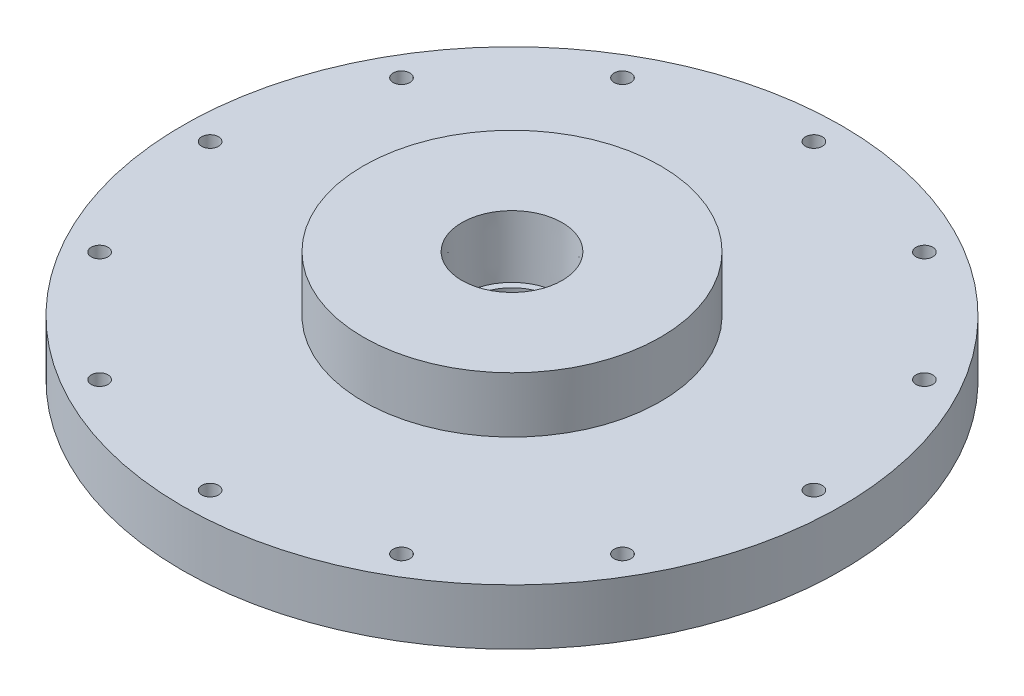
ISO-10303-21;
HEADER;
FILE_DESCRIPTION(('STEP AP214'),'2;1');
FILE_NAME('part.step','',(''),(''),'','','');
FILE_SCHEMA(('AUTOMOTIVE_DESIGN { 1 0 10303 214 1 1 1 1 }'));
ENDSEC;
DATA;
#1=APPLICATION_CONTEXT('core data for automotive mechanical design processes');
#2=APPLICATION_PROTOCOL_DEFINITION('international standard','automotive_design',2000,#1);
#3=PRODUCT_CONTEXT('',#1,'mechanical');
#4=PRODUCT('Part','Part','',(#3));
#5=PRODUCT_RELATED_PRODUCT_CATEGORY('part','',(#4));
#6=PRODUCT_DEFINITION_FORMATION('','',#4);
#7=PRODUCT_DEFINITION_CONTEXT('part definition',#1,'design');
#8=PRODUCT_DEFINITION('design','',#6,#7);
#9=PRODUCT_DEFINITION_SHAPE('','',#8);
#10=(LENGTH_UNIT() NAMED_UNIT(*) SI_UNIT(.MILLI.,.METRE.));
#11=(NAMED_UNIT(*) PLANE_ANGLE_UNIT() SI_UNIT($,.RADIAN.));
#12=(NAMED_UNIT(*) SI_UNIT($,.STERADIAN.) SOLID_ANGLE_UNIT());
#13=UNCERTAINTY_MEASURE_WITH_UNIT(LENGTH_MEASURE(1.E-05),#10,'distance_accuracy_value','');
#14=(GEOMETRIC_REPRESENTATION_CONTEXT(3) GLOBAL_UNCERTAINTY_ASSIGNED_CONTEXT((#13)) GLOBAL_UNIT_ASSIGNED_CONTEXT((#10,
#11,#12)) REPRESENTATION_CONTEXT('',''));
#15=CARTESIAN_POINT('',(0.,0.,0.));
#16=DIRECTION('',(0.,0.,1.));
#17=DIRECTION('',(1.,0.,0.));
#18=AXIS2_PLACEMENT_3D('',#15,#16,#17);
#19=CARTESIAN_POINT('',(0.,19.05,0.));
#20=DIRECTION('',(0.,-1.,0.));
#21=DIRECTION('',(0.,0.,-1.));
#22=AXIS2_PLACEMENT_3D('',#19,#20,#21);
#23=CYLINDRICAL_SURFACE('',#22,25.4);
#24=CARTESIAN_POINT('',(0.,19.05,0.));
#25=DIRECTION('',(0.,1.,0.));
#26=DIRECTION('',(0.,0.,1.));
#27=AXIS2_PLACEMENT_3D('',#24,#25,#26);
#28=CIRCLE('',#27,25.4);
#29=CARTESIAN_POINT('',(0.,19.05,25.4));
#30=VERTEX_POINT('',#29);
#31=EDGE_CURVE('E44',#30,#30,#28,.T.);
#32=ORIENTED_EDGE('',*,*,#31,.F.);
#33=EDGE_LOOP('',(#32));
#34=FACE_BOUND('',#33,.T.);
#35=CARTESIAN_POINT('',(0.,9.525,0.));
#36=DIRECTION('',(0.,-1.,0.));
#37=DIRECTION('',(0.,0.,-1.));
#38=AXIS2_PLACEMENT_3D('',#35,#36,#37);
#39=CIRCLE('',#38,25.4);
#40=CARTESIAN_POINT('',(0.,9.525,-25.4));
#41=VERTEX_POINT('',#40);
#42=EDGE_CURVE('E10',#41,#41,#39,.T.);
#43=ORIENTED_EDGE('',*,*,#42,.F.);
#44=EDGE_LOOP('',(#43));
#45=FACE_BOUND('',#44,.T.);
#46=ADVANCED_FACE('F37',(#34,#45),#23,.T.);
#47=CARTESIAN_POINT('',(0.,19.05,0.));
#48=DIRECTION('',(0.,1.,0.));
#49=DIRECTION('',(0.,0.,1.));
#50=AXIS2_PLACEMENT_3D('',#47,#48,#49);
#51=PLANE('',#50);
#52=CARTESIAN_POINT('',(0.,19.05,0.));
#53=DIRECTION('',(0.,1.,0.));
#54=DIRECTION('',(0.,0.,1.));
#55=AXIS2_PLACEMENT_3D('',#52,#53,#54);
#56=CIRCLE('',#55,8.5750146);
#57=CARTESIAN_POINT('',(0.,19.05,8.5750146));
#58=VERTEX_POINT('',#57);
#59=EDGE_CURVE('E137',#58,#58,#56,.T.);
#60=ORIENTED_EDGE('',*,*,#59,.F.);
#61=EDGE_LOOP('',(#60));
#62=FACE_BOUND('',#61,.T.);
#63=ORIENTED_EDGE('',*,*,#31,.T.);
#64=EDGE_LOOP('',(#63));
#65=FACE_BOUND('',#64,.T.);
#66=ADVANCED_FACE('F143',(#62,#65),#51,.T.);
#67=CARTESIAN_POINT('',(0.,9.525,0.));
#68=DIRECTION('',(0.,-1.,0.));
#69=DIRECTION('',(0.,0.,-1.));
#70=AXIS2_PLACEMENT_3D('',#67,#68,#69);
#71=CYLINDRICAL_SURFACE('',#70,56.35625);
#72=CARTESIAN_POINT('',(0.,9.525,0.));
#73=DIRECTION('',(0.,-1.,0.));
#74=DIRECTION('',(0.,0.,-1.));
#75=AXIS2_PLACEMENT_3D('',#72,#73,#74);
#76=CIRCLE('',#75,56.35625);
#77=CARTESIAN_POINT('',(0.,9.525,-56.35625));
#78=VERTEX_POINT('',#77);
#79=EDGE_CURVE('E48',#78,#78,#76,.T.);
#80=ORIENTED_EDGE('',*,*,#79,.T.);
#81=EDGE_LOOP('',(#80));
#82=FACE_BOUND('',#81,.T.);
#83=CARTESIAN_POINT('',(0.,0.,0.));
#84=DIRECTION('',(0.,-1.,0.));
#85=DIRECTION('',(0.,0.,-1.));
#86=AXIS2_PLACEMENT_3D('',#83,#84,#85);
#87=CIRCLE('',#86,56.35625);
#88=CARTESIAN_POINT('',(0.,0.,-56.35625));
#89=VERTEX_POINT('',#88);
#90=EDGE_CURVE('E51',#89,#89,#87,.T.);
#91=ORIENTED_EDGE('',*,*,#90,.F.);
#92=EDGE_LOOP('',(#91));
#93=FACE_BOUND('',#92,.T.);
#94=ADVANCED_FACE('F146',(#82,#93),#71,.T.);
#95=CARTESIAN_POINT('',(0.,9.525,0.));
#96=DIRECTION('',(0.,-1.,0.));
#97=DIRECTION('',(0.,0.,-1.));
#98=AXIS2_PLACEMENT_3D('',#95,#96,#97);
#99=PLANE('',#98);
#100=CARTESIAN_POINT('',(44.7089944830735,9.525,-25.81275));
#101=DIRECTION('',(0.,-1.,0.));
#102=DIRECTION('',(0.,0.,-1.));
#103=AXIS2_PLACEMENT_3D('',#100,#101,#102);
#104=CIRCLE('',#103,1.4351);
#105=CARTESIAN_POINT('',(44.7089944830735,9.525,-27.24785));
#106=VERTEX_POINT('',#105);
#107=EDGE_CURVE('E122',#106,#106,#104,.T.);
#108=ORIENTED_EDGE('',*,*,#107,.T.);
#109=EDGE_LOOP('',(#108));
#110=FACE_BOUND('',#109,.T.);
#111=CARTESIAN_POINT('',(25.81275,9.525,-44.7089944830735));
#112=DIRECTION('',(0.,-1.,0.));
#113=DIRECTION('',(0.,0.,-1.));
#114=AXIS2_PLACEMENT_3D('',#111,#112,#113);
#115=CIRCLE('',#114,1.4351);
#116=CARTESIAN_POINT('',(25.81275,9.525,-46.1440944830735));
#117=VERTEX_POINT('',#116);
#118=EDGE_CURVE('E116',#117,#117,#115,.T.);
#119=ORIENTED_EDGE('',*,*,#118,.T.);
#120=EDGE_LOOP('',(#119));
#121=FACE_BOUND('',#120,.T.);
#122=CARTESIAN_POINT('',(0.,9.525,-51.6255));
#123=DIRECTION('',(0.,-1.,0.));
#124=DIRECTION('',(0.,0.,-1.));
#125=AXIS2_PLACEMENT_3D('',#122,#123,#124);
#126=CIRCLE('',#125,1.4351);
#127=CARTESIAN_POINT('',(0.,9.525,-53.0606));
#128=VERTEX_POINT('',#127);
#129=EDGE_CURVE('E110',#128,#128,#126,.T.);
#130=ORIENTED_EDGE('',*,*,#129,.T.);
#131=EDGE_LOOP('',(#130));
#132=FACE_BOUND('',#131,.T.);
#133=CARTESIAN_POINT('',(-25.81275,9.525,-44.7089944830735));
#134=DIRECTION('',(0.,-1.,0.));
#135=DIRECTION('',(0.,0.,-1.));
#136=AXIS2_PLACEMENT_3D('',#133,#134,#135);
#137=CIRCLE('',#136,1.4351);
#138=CARTESIAN_POINT('',(-25.81275,9.525,-46.1440944830736));
#139=VERTEX_POINT('',#138);
#140=EDGE_CURVE('E104',#139,#139,#137,.T.);
#141=ORIENTED_EDGE('',*,*,#140,.T.);
#142=EDGE_LOOP('',(#141));
#143=FACE_BOUND('',#142,.T.);
#144=CARTESIAN_POINT('',(-44.7089944830735,9.525,-25.81275));
#145=DIRECTION('',(0.,-1.,0.));
#146=DIRECTION('',(0.,0.,-1.));
#147=AXIS2_PLACEMENT_3D('',#144,#145,#146);
#148=CIRCLE('',#147,1.43509999999999);
#149=CARTESIAN_POINT('',(-44.7089944830735,9.525,-27.24785));
#150=VERTEX_POINT('',#149);
#151=EDGE_CURVE('E98',#150,#150,#148,.T.);
#152=ORIENTED_EDGE('',*,*,#151,.T.);
#153=EDGE_LOOP('',(#152));
#154=FACE_BOUND('',#153,.T.);
#155=CARTESIAN_POINT('',(-51.6255,9.525,0.));
#156=DIRECTION('',(0.,-1.,0.));
#157=DIRECTION('',(0.,0.,-1.));
#158=AXIS2_PLACEMENT_3D('',#155,#156,#157);
#159=CIRCLE('',#158,1.43509999999999);
#160=CARTESIAN_POINT('',(-51.6255,9.525,-1.43509999999999));
#161=VERTEX_POINT('',#160);
#162=EDGE_CURVE('E92',#161,#161,#159,.T.);
#163=ORIENTED_EDGE('',*,*,#162,.T.);
#164=EDGE_LOOP('',(#163));
#165=FACE_BOUND('',#164,.T.);
#166=CARTESIAN_POINT('',(-44.7089944830735,9.525,25.81275));
#167=DIRECTION('',(0.,-1.,0.));
#168=DIRECTION('',(0.,0.,-1.));
#169=AXIS2_PLACEMENT_3D('',#166,#167,#168);
#170=CIRCLE('',#169,1.4351);
#171=CARTESIAN_POINT('',(-44.7089944830735,9.525,24.37765));
#172=VERTEX_POINT('',#171);
#173=EDGE_CURVE('E86',#172,#172,#170,.T.);
#174=ORIENTED_EDGE('',*,*,#173,.T.);
#175=EDGE_LOOP('',(#174));
#176=FACE_BOUND('',#175,.T.);
#177=CARTESIAN_POINT('',(-25.81275,9.525,44.7089944830735));
#178=DIRECTION('',(0.,-1.,0.));
#179=DIRECTION('',(0.,0.,-1.));
#180=AXIS2_PLACEMENT_3D('',#177,#178,#179);
#181=CIRCLE('',#180,1.4351);
#182=CARTESIAN_POINT('',(-25.81275,9.525,43.2738944830735));
#183=VERTEX_POINT('',#182);
#184=EDGE_CURVE('E80',#183,#183,#181,.T.);
#185=ORIENTED_EDGE('',*,*,#184,.T.);
#186=EDGE_LOOP('',(#185));
#187=FACE_BOUND('',#186,.T.);
#188=CARTESIAN_POINT('',(0.,9.525,51.6255));
#189=DIRECTION('',(0.,-1.,0.));
#190=DIRECTION('',(0.,0.,-1.));
#191=AXIS2_PLACEMENT_3D('',#188,#189,#190);
#192=CIRCLE('',#191,1.4351);
#193=CARTESIAN_POINT('',(0.,9.525,50.1904));
#194=VERTEX_POINT('',#193);
#195=EDGE_CURVE('E74',#194,#194,#192,.T.);
#196=ORIENTED_EDGE('',*,*,#195,.T.);
#197=EDGE_LOOP('',(#196));
#198=FACE_BOUND('',#197,.T.);
#199=CARTESIAN_POINT('',(25.81275,9.525,44.7089944830735));
#200=DIRECTION('',(0.,-1.,0.));
#201=DIRECTION('',(0.,0.,-1.));
#202=AXIS2_PLACEMENT_3D('',#199,#200,#201);
#203=CIRCLE('',#202,1.4351);
#204=CARTESIAN_POINT('',(25.81275,9.525,43.2738944830735));
#205=VERTEX_POINT('',#204);
#206=EDGE_CURVE('E68',#205,#205,#203,.T.);
#207=ORIENTED_EDGE('',*,*,#206,.T.);
#208=EDGE_LOOP('',(#207));
#209=FACE_BOUND('',#208,.T.);
#210=CARTESIAN_POINT('',(44.7089944830735,9.525,25.81275));
#211=DIRECTION('',(0.,-1.,0.));
#212=DIRECTION('',(0.,0.,-1.));
#213=AXIS2_PLACEMENT_3D('',#210,#211,#212);
#214=CIRCLE('',#213,1.4351);
#215=CARTESIAN_POINT('',(44.7089944830735,9.525,24.37765));
#216=VERTEX_POINT('',#215);
#217=EDGE_CURVE('E62',#216,#216,#214,.T.);
#218=ORIENTED_EDGE('',*,*,#217,.T.);
#219=EDGE_LOOP('',(#218));
#220=FACE_BOUND('',#219,.T.);
#221=CARTESIAN_POINT('',(51.6255,9.525,0.));
#222=DIRECTION('',(0.,-1.,0.));
#223=DIRECTION('',(0.,0.,-1.));
#224=AXIS2_PLACEMENT_3D('',#221,#222,#223);
#225=CIRCLE('',#224,1.43509999999999);
#226=CARTESIAN_POINT('',(51.6255,9.525,-1.43509999999999));
#227=VERTEX_POINT('',#226);
#228=EDGE_CURVE('E54',#227,#227,#225,.T.);
#229=ORIENTED_EDGE('',*,*,#228,.T.);
#230=EDGE_LOOP('',(#229));
#231=FACE_BOUND('',#230,.T.);
#232=ORIENTED_EDGE('',*,*,#42,.T.);
#233=EDGE_LOOP('',(#232));
#234=FACE_BOUND('',#233,.T.);
#235=ORIENTED_EDGE('',*,*,#79,.F.);
#236=EDGE_LOOP('',(#235));
#237=FACE_BOUND('',#236,.T.);
#238=ADVANCED_FACE('F166',(#110,#121,#132,#143,#154,#165,#176,#187,#198,#209,#220,#231,#234,
#237),#99,.F.);
#239=CARTESIAN_POINT('',(0.,0.,0.));
#240=DIRECTION('',(0.,1.,0.));
#241=DIRECTION('',(0.,0.,1.));
#242=AXIS2_PLACEMENT_3D('',#239,#240,#241);
#243=PLANE('',#242);
#244=CARTESIAN_POINT('',(0.,0.,0.));
#245=DIRECTION('',(0.,1.,0.));
#246=DIRECTION('',(0.,0.,1.));
#247=AXIS2_PLACEMENT_3D('',#244,#245,#246);
#248=CIRCLE('',#247,4.60103806889781);
#249=CARTESIAN_POINT('',(0.,0.,4.60103806889781));
#250=VERTEX_POINT('',#249);
#251=EDGE_CURVE('E40',#250,#250,#248,.T.);
#252=ORIENTED_EDGE('',*,*,#251,.T.);
#253=EDGE_LOOP('',(#252));
#254=FACE_BOUND('',#253,.T.);
#255=CARTESIAN_POINT('',(44.7089944830735,0.,-25.81275));
#256=DIRECTION('',(0.,-1.,0.));
#257=DIRECTION('',(0.,0.,-1.));
#258=AXIS2_PLACEMENT_3D('',#255,#256,#257);
#259=CIRCLE('',#258,1.4351);
#260=CARTESIAN_POINT('',(44.7089944830735,0.,-27.24785));
#261=VERTEX_POINT('',#260);
#262=EDGE_CURVE('E125',#261,#261,#259,.T.);
#263=ORIENTED_EDGE('',*,*,#262,.F.);
#264=EDGE_LOOP('',(#263));
#265=FACE_BOUND('',#264,.T.);
#266=CARTESIAN_POINT('',(25.81275,0.,-44.7089944830735));
#267=DIRECTION('',(0.,-1.,0.));
#268=DIRECTION('',(0.,0.,-1.));
#269=AXIS2_PLACEMENT_3D('',#266,#267,#268);
#270=CIRCLE('',#269,1.4351);
#271=CARTESIAN_POINT('',(25.81275,0.,-46.1440944830735));
#272=VERTEX_POINT('',#271);
#273=EDGE_CURVE('E119',#272,#272,#270,.T.);
#274=ORIENTED_EDGE('',*,*,#273,.F.);
#275=EDGE_LOOP('',(#274));
#276=FACE_BOUND('',#275,.T.);
#277=CARTESIAN_POINT('',(0.,0.,-51.6255));
#278=DIRECTION('',(0.,-1.,0.));
#279=DIRECTION('',(0.,0.,-1.));
#280=AXIS2_PLACEMENT_3D('',#277,#278,#279);
#281=CIRCLE('',#280,1.4351);
#282=CARTESIAN_POINT('',(0.,0.,-53.0606));
#283=VERTEX_POINT('',#282);
#284=EDGE_CURVE('E113',#283,#283,#281,.T.);
#285=ORIENTED_EDGE('',*,*,#284,.F.);
#286=EDGE_LOOP('',(#285));
#287=FACE_BOUND('',#286,.T.);
#288=CARTESIAN_POINT('',(-25.81275,0.,-44.7089944830735));
#289=DIRECTION('',(0.,-1.,0.));
#290=DIRECTION('',(0.,0.,-1.));
#291=AXIS2_PLACEMENT_3D('',#288,#289,#290);
#292=CIRCLE('',#291,1.4351);
#293=CARTESIAN_POINT('',(-25.81275,0.,-46.1440944830736));
#294=VERTEX_POINT('',#293);
#295=EDGE_CURVE('E107',#294,#294,#292,.T.);
#296=ORIENTED_EDGE('',*,*,#295,.F.);
#297=EDGE_LOOP('',(#296));
#298=FACE_BOUND('',#297,.T.);
#299=CARTESIAN_POINT('',(-44.7089944830735,0.,-25.81275));
#300=DIRECTION('',(0.,-1.,0.));
#301=DIRECTION('',(0.,0.,-1.));
#302=AXIS2_PLACEMENT_3D('',#299,#300,#301);
#303=CIRCLE('',#302,1.43509999999999);
#304=CARTESIAN_POINT('',(-44.7089944830735,0.,-27.24785));
#305=VERTEX_POINT('',#304);
#306=EDGE_CURVE('E101',#305,#305,#303,.T.);
#307=ORIENTED_EDGE('',*,*,#306,.F.);
#308=EDGE_LOOP('',(#307));
#309=FACE_BOUND('',#308,.T.);
#310=CARTESIAN_POINT('',(-51.6255,0.,0.));
#311=DIRECTION('',(0.,-1.,0.));
#312=DIRECTION('',(0.,0.,-1.));
#313=AXIS2_PLACEMENT_3D('',#310,#311,#312);
#314=CIRCLE('',#313,1.43509999999999);
#315=CARTESIAN_POINT('',(-51.6255,0.,-1.43509999999999));
#316=VERTEX_POINT('',#315);
#317=EDGE_CURVE('E95',#316,#316,#314,.T.);
#318=ORIENTED_EDGE('',*,*,#317,.F.);
#319=EDGE_LOOP('',(#318));
#320=FACE_BOUND('',#319,.T.);
#321=CARTESIAN_POINT('',(-44.7089944830735,0.,25.81275));
#322=DIRECTION('',(0.,-1.,0.));
#323=DIRECTION('',(0.,0.,-1.));
#324=AXIS2_PLACEMENT_3D('',#321,#322,#323);
#325=CIRCLE('',#324,1.4351);
#326=CARTESIAN_POINT('',(-44.7089944830735,0.,24.37765));
#327=VERTEX_POINT('',#326);
#328=EDGE_CURVE('E89',#327,#327,#325,.T.);
#329=ORIENTED_EDGE('',*,*,#328,.F.);
#330=EDGE_LOOP('',(#329));
#331=FACE_BOUND('',#330,.T.);
#332=CARTESIAN_POINT('',(-25.81275,0.,44.7089944830735));
#333=DIRECTION('',(0.,-1.,0.));
#334=DIRECTION('',(0.,0.,-1.));
#335=AXIS2_PLACEMENT_3D('',#332,#333,#334);
#336=CIRCLE('',#335,1.4351);
#337=CARTESIAN_POINT('',(-25.81275,0.,43.2738944830735));
#338=VERTEX_POINT('',#337);
#339=EDGE_CURVE('E83',#338,#338,#336,.T.);
#340=ORIENTED_EDGE('',*,*,#339,.F.);
#341=EDGE_LOOP('',(#340));
#342=FACE_BOUND('',#341,.T.);
#343=CARTESIAN_POINT('',(0.,0.,51.6255));
#344=DIRECTION('',(0.,-1.,0.));
#345=DIRECTION('',(0.,0.,-1.));
#346=AXIS2_PLACEMENT_3D('',#343,#344,#345);
#347=CIRCLE('',#346,1.4351);
#348=CARTESIAN_POINT('',(0.,0.,50.1904));
#349=VERTEX_POINT('',#348);
#350=EDGE_CURVE('E77',#349,#349,#347,.T.);
#351=ORIENTED_EDGE('',*,*,#350,.F.);
#352=EDGE_LOOP('',(#351));
#353=FACE_BOUND('',#352,.T.);
#354=CARTESIAN_POINT('',(25.81275,0.,44.7089944830735));
#355=DIRECTION('',(0.,-1.,0.));
#356=DIRECTION('',(0.,0.,-1.));
#357=AXIS2_PLACEMENT_3D('',#354,#355,#356);
#358=CIRCLE('',#357,1.4351);
#359=CARTESIAN_POINT('',(25.81275,0.,43.2738944830735));
#360=VERTEX_POINT('',#359);
#361=EDGE_CURVE('E71',#360,#360,#358,.T.);
#362=ORIENTED_EDGE('',*,*,#361,.F.);
#363=EDGE_LOOP('',(#362));
#364=FACE_BOUND('',#363,.T.);
#365=CARTESIAN_POINT('',(44.7089944830735,0.,25.81275));
#366=DIRECTION('',(0.,-1.,0.));
#367=DIRECTION('',(0.,0.,-1.));
#368=AXIS2_PLACEMENT_3D('',#365,#366,#367);
#369=CIRCLE('',#368,1.4351);
#370=CARTESIAN_POINT('',(44.7089944830735,0.,24.37765));
#371=VERTEX_POINT('',#370);
#372=EDGE_CURVE('E65',#371,#371,#369,.T.);
#373=ORIENTED_EDGE('',*,*,#372,.F.);
#374=EDGE_LOOP('',(#373));
#375=FACE_BOUND('',#374,.T.);
#376=CARTESIAN_POINT('',(51.6255,0.,0.));
#377=DIRECTION('',(0.,-1.,0.));
#378=DIRECTION('',(0.,0.,-1.));
#379=AXIS2_PLACEMENT_3D('',#376,#377,#378);
#380=CIRCLE('',#379,1.43509999999999);
#381=CARTESIAN_POINT('',(51.6255,0.,-1.43509999999999));
#382=VERTEX_POINT('',#381);
#383=EDGE_CURVE('E59',#382,#382,#380,.T.);
#384=ORIENTED_EDGE('',*,*,#383,.F.);
#385=EDGE_LOOP('',(#384));
#386=FACE_BOUND('',#385,.T.);
#387=ORIENTED_EDGE('',*,*,#90,.T.);
#388=EDGE_LOOP('',(#387));
#389=FACE_BOUND('',#388,.T.);
#390=ADVANCED_FACE('F174',(#254,#265,#276,#287,#298,#309,#320,#331,#342,#353,#364,#375,#386,
#389),#243,.F.);
#391=CARTESIAN_POINT('',(51.6255,0.,0.));
#392=DIRECTION('',(0.,-1.,0.));
#393=DIRECTION('',(0.,0.,-1.));
#394=AXIS2_PLACEMENT_3D('',#391,#392,#393);
#395=CYLINDRICAL_SURFACE('',#394,1.43509999999999);
#396=ORIENTED_EDGE('',*,*,#228,.F.);
#397=EDGE_LOOP('',(#396));
#398=FACE_BOUND('',#397,.T.);
#399=ORIENTED_EDGE('',*,*,#383,.T.);
#400=EDGE_LOOP('',(#399));
#401=FACE_BOUND('',#400,.T.);
#402=ADVANCED_FACE('F182',(#398,#401),#395,.F.);
#403=CARTESIAN_POINT('',(44.7089944830735,0.,25.81275));
#404=DIRECTION('',(0.,-1.,0.));
#405=DIRECTION('',(0.,0.,-1.));
#406=AXIS2_PLACEMENT_3D('',#403,#404,#405);
#407=CYLINDRICAL_SURFACE('',#406,1.4351);
#408=ORIENTED_EDGE('',*,*,#217,.F.);
#409=EDGE_LOOP('',(#408));
#410=FACE_BOUND('',#409,.T.);
#411=ORIENTED_EDGE('',*,*,#372,.T.);
#412=EDGE_LOOP('',(#411));
#413=FACE_BOUND('',#412,.T.);
#414=ADVANCED_FACE('F189',(#410,#413),#407,.F.);
#415=CARTESIAN_POINT('',(25.81275,0.,44.7089944830735));
#416=DIRECTION('',(0.,-1.,0.));
#417=DIRECTION('',(0.,0.,-1.));
#418=AXIS2_PLACEMENT_3D('',#415,#416,#417);
#419=CYLINDRICAL_SURFACE('',#418,1.4351);
#420=ORIENTED_EDGE('',*,*,#206,.F.);
#421=EDGE_LOOP('',(#420));
#422=FACE_BOUND('',#421,.T.);
#423=ORIENTED_EDGE('',*,*,#361,.T.);
#424=EDGE_LOOP('',(#423));
#425=FACE_BOUND('',#424,.T.);
#426=ADVANCED_FACE('F197',(#422,#425),#419,.F.);
#427=CARTESIAN_POINT('',(0.,0.,51.6255));
#428=DIRECTION('',(0.,-1.,0.));
#429=DIRECTION('',(0.,0.,-1.));
#430=AXIS2_PLACEMENT_3D('',#427,#428,#429);
#431=CYLINDRICAL_SURFACE('',#430,1.4351);
#432=ORIENTED_EDGE('',*,*,#195,.F.);
#433=EDGE_LOOP('',(#432));
#434=FACE_BOUND('',#433,.T.);
#435=ORIENTED_EDGE('',*,*,#350,.T.);
#436=EDGE_LOOP('',(#435));
#437=FACE_BOUND('',#436,.T.);
#438=ADVANCED_FACE('F205',(#434,#437),#431,.F.);
#439=CARTESIAN_POINT('',(-25.81275,0.,44.7089944830735));
#440=DIRECTION('',(0.,-1.,0.));
#441=DIRECTION('',(0.,0.,-1.));
#442=AXIS2_PLACEMENT_3D('',#439,#440,#441);
#443=CYLINDRICAL_SURFACE('',#442,1.4351);
#444=ORIENTED_EDGE('',*,*,#184,.F.);
#445=EDGE_LOOP('',(#444));
#446=FACE_BOUND('',#445,.T.);
#447=ORIENTED_EDGE('',*,*,#339,.T.);
#448=EDGE_LOOP('',(#447));
#449=FACE_BOUND('',#448,.T.);
#450=ADVANCED_FACE('F213',(#446,#449),#443,.F.);
#451=CARTESIAN_POINT('',(-44.7089944830735,0.,25.81275));
#452=DIRECTION('',(0.,-1.,0.));
#453=DIRECTION('',(0.,0.,-1.));
#454=AXIS2_PLACEMENT_3D('',#451,#452,#453);
#455=CYLINDRICAL_SURFACE('',#454,1.4351);
#456=ORIENTED_EDGE('',*,*,#173,.F.);
#457=EDGE_LOOP('',(#456));
#458=FACE_BOUND('',#457,.T.);
#459=ORIENTED_EDGE('',*,*,#328,.T.);
#460=EDGE_LOOP('',(#459));
#461=FACE_BOUND('',#460,.T.);
#462=ADVANCED_FACE('F221',(#458,#461),#455,.F.);
#463=CARTESIAN_POINT('',(-51.6255,0.,0.));
#464=DIRECTION('',(0.,-1.,0.));
#465=DIRECTION('',(0.,0.,-1.));
#466=AXIS2_PLACEMENT_3D('',#463,#464,#465);
#467=CYLINDRICAL_SURFACE('',#466,1.43509999999999);
#468=ORIENTED_EDGE('',*,*,#162,.F.);
#469=EDGE_LOOP('',(#468));
#470=FACE_BOUND('',#469,.T.);
#471=ORIENTED_EDGE('',*,*,#317,.T.);
#472=EDGE_LOOP('',(#471));
#473=FACE_BOUND('',#472,.T.);
#474=ADVANCED_FACE('F229',(#470,#473),#467,.F.);
#475=CARTESIAN_POINT('',(-44.7089944830735,0.,-25.81275));
#476=DIRECTION('',(0.,-1.,0.));
#477=DIRECTION('',(0.,0.,-1.));
#478=AXIS2_PLACEMENT_3D('',#475,#476,#477);
#479=CYLINDRICAL_SURFACE('',#478,1.43509999999999);
#480=ORIENTED_EDGE('',*,*,#151,.F.);
#481=EDGE_LOOP('',(#480));
#482=FACE_BOUND('',#481,.T.);
#483=ORIENTED_EDGE('',*,*,#306,.T.);
#484=EDGE_LOOP('',(#483));
#485=FACE_BOUND('',#484,.T.);
#486=ADVANCED_FACE('F237',(#482,#485),#479,.F.);
#487=CARTESIAN_POINT('',(-25.81275,0.,-44.7089944830735));
#488=DIRECTION('',(0.,-1.,0.));
#489=DIRECTION('',(0.,0.,-1.));
#490=AXIS2_PLACEMENT_3D('',#487,#488,#489);
#491=CYLINDRICAL_SURFACE('',#490,1.4351);
#492=ORIENTED_EDGE('',*,*,#140,.F.);
#493=EDGE_LOOP('',(#492));
#494=FACE_BOUND('',#493,.T.);
#495=ORIENTED_EDGE('',*,*,#295,.T.);
#496=EDGE_LOOP('',(#495));
#497=FACE_BOUND('',#496,.T.);
#498=ADVANCED_FACE('F245',(#494,#497),#491,.F.);
#499=CARTESIAN_POINT('',(0.,0.,-51.6255));
#500=DIRECTION('',(0.,-1.,0.));
#501=DIRECTION('',(0.,0.,-1.));
#502=AXIS2_PLACEMENT_3D('',#499,#500,#501);
#503=CYLINDRICAL_SURFACE('',#502,1.4351);
#504=ORIENTED_EDGE('',*,*,#129,.F.);
#505=EDGE_LOOP('',(#504));
#506=FACE_BOUND('',#505,.T.);
#507=ORIENTED_EDGE('',*,*,#284,.T.);
#508=EDGE_LOOP('',(#507));
#509=FACE_BOUND('',#508,.T.);
#510=ADVANCED_FACE('F253',(#506,#509),#503,.F.);
#511=CARTESIAN_POINT('',(25.81275,0.,-44.7089944830735));
#512=DIRECTION('',(0.,-1.,0.));
#513=DIRECTION('',(0.,0.,-1.));
#514=AXIS2_PLACEMENT_3D('',#511,#512,#513);
#515=CYLINDRICAL_SURFACE('',#514,1.4351);
#516=ORIENTED_EDGE('',*,*,#118,.F.);
#517=EDGE_LOOP('',(#516));
#518=FACE_BOUND('',#517,.T.);
#519=ORIENTED_EDGE('',*,*,#273,.T.);
#520=EDGE_LOOP('',(#519));
#521=FACE_BOUND('',#520,.T.);
#522=ADVANCED_FACE('F261',(#518,#521),#515,.F.);
#523=CARTESIAN_POINT('',(44.7089944830735,0.,-25.81275));
#524=DIRECTION('',(0.,-1.,0.));
#525=DIRECTION('',(0.,0.,-1.));
#526=AXIS2_PLACEMENT_3D('',#523,#524,#525);
#527=CYLINDRICAL_SURFACE('',#526,1.4351);
#528=ORIENTED_EDGE('',*,*,#107,.F.);
#529=EDGE_LOOP('',(#528));
#530=FACE_BOUND('',#529,.T.);
#531=ORIENTED_EDGE('',*,*,#262,.T.);
#532=EDGE_LOOP('',(#531));
#533=FACE_BOUND('',#532,.T.);
#534=ADVANCED_FACE('F269',(#530,#533),#527,.F.);
#535=CARTESIAN_POINT('',(0.,1.524,0.));
#536=DIRECTION('',(0.,1.,0.));
#537=DIRECTION('',(0.,0.,1.));
#538=AXIS2_PLACEMENT_3D('',#535,#536,#537);
#539=CONICAL_SURFACE('',#538,7.1374,1.02974425867665);
#540=CARTESIAN_POINT('',(0.,1.524,0.));
#541=DIRECTION('',(0.,1.,0.));
#542=DIRECTION('',(0.,0.,1.));
#543=AXIS2_PLACEMENT_3D('',#540,#541,#542);
#544=CIRCLE('',#543,7.1374);
#545=CARTESIAN_POINT('',(0.,1.524,7.1374));
#546=VERTEX_POINT('',#545);
#547=EDGE_CURVE('E128',#546,#546,#544,.T.);
#548=ORIENTED_EDGE('',*,*,#547,.T.);
#549=EDGE_LOOP('',(#548));
#550=FACE_BOUND('',#549,.T.);
#551=ORIENTED_EDGE('',*,*,#251,.F.);
#552=EDGE_LOOP('',(#551));
#553=FACE_BOUND('',#552,.T.);
#554=ADVANCED_FACE('F276',(#550,#553),#539,.F.);
#555=CARTESIAN_POINT('',(0.,19.05,0.));
#556=DIRECTION('',(0.,1.,0.));
#557=DIRECTION('',(0.,0.,1.));
#558=AXIS2_PLACEMENT_3D('',#555,#556,#557);
#559=CYLINDRICAL_SURFACE('',#558,7.1374);
#560=ORIENTED_EDGE('',*,*,#547,.F.);
#561=EDGE_LOOP('',(#560));
#562=FACE_BOUND('',#561,.T.);
#563=CARTESIAN_POINT('',(0.,8.636,0.));
#564=DIRECTION('',(0.,1.,0.));
#565=DIRECTION('',(0.,0.,1.));
#566=AXIS2_PLACEMENT_3D('',#563,#564,#565);
#567=CIRCLE('',#566,7.1374);
#568=CARTESIAN_POINT('',(0.,8.636,7.1374));
#569=VERTEX_POINT('',#568);
#570=EDGE_CURVE('E131',#569,#569,#567,.T.);
#571=ORIENTED_EDGE('',*,*,#570,.T.);
#572=EDGE_LOOP('',(#571));
#573=FACE_BOUND('',#572,.T.);
#574=ADVANCED_FACE('F283',(#562,#573),#559,.F.);
#575=CARTESIAN_POINT('',(7.1374,8.636,0.));
#576=DIRECTION('',(0.,-1.,0.));
#577=DIRECTION('',(0.,0.,-1.));
#578=AXIS2_PLACEMENT_3D('',#575,#576,#577);
#579=PLANE('',#578);
#580=ORIENTED_EDGE('',*,*,#570,.F.);
#581=EDGE_LOOP('',(#580));
#582=FACE_BOUND('',#581,.T.);
#583=CARTESIAN_POINT('',(0.,8.636,0.));
#584=DIRECTION('',(0.,1.,0.));
#585=DIRECTION('',(0.,0.,1.));
#586=AXIS2_PLACEMENT_3D('',#583,#584,#585);
#587=CIRCLE('',#586,8.26320549387809);
#588=CARTESIAN_POINT('',(0.,8.636,8.26320549387809));
#589=VERTEX_POINT('',#588);
#590=EDGE_CURVE('E134',#589,#589,#587,.T.);
#591=ORIENTED_EDGE('',*,*,#590,.T.);
#592=EDGE_LOOP('',(#591));
#593=FACE_BOUND('',#592,.T.);
#594=ADVANCED_FACE('F291',(#582,#593),#579,.F.);
#595=CARTESIAN_POINT('',(0.,19.05,0.));
#596=DIRECTION('',(0.,1.,0.));
#597=DIRECTION('',(0.,0.,1.));
#598=AXIS2_PLACEMENT_3D('',#595,#596,#597);
#599=CONICAL_SURFACE('',#598,8.5750146,0.0299323966717029);
#600=ORIENTED_EDGE('',*,*,#590,.F.);
#601=EDGE_LOOP('',(#600));
#602=FACE_BOUND('',#601,.T.);
#603=ORIENTED_EDGE('',*,*,#59,.T.);
#604=EDGE_LOOP('',(#603));
#605=FACE_BOUND('',#604,.T.);
#606=ADVANCED_FACE('F141',(#602,#605),#599,.F.);
#607=CLOSED_SHELL('',(#46,#66,#94,#238,#390,#402,#414,#426,#438,#450,#462,#474,#486,#498,#510,
#522,#534,#554,#574,#594,#606));
#608=MANIFOLD_SOLID_BREP('B2',#607);
#609=ADVANCED_BREP_SHAPE_REPRESENTATION('',(#18,#608),#14);
#610=SHAPE_DEFINITION_REPRESENTATION(#9,#609);
ENDSEC;
END-ISO-10303-21;
